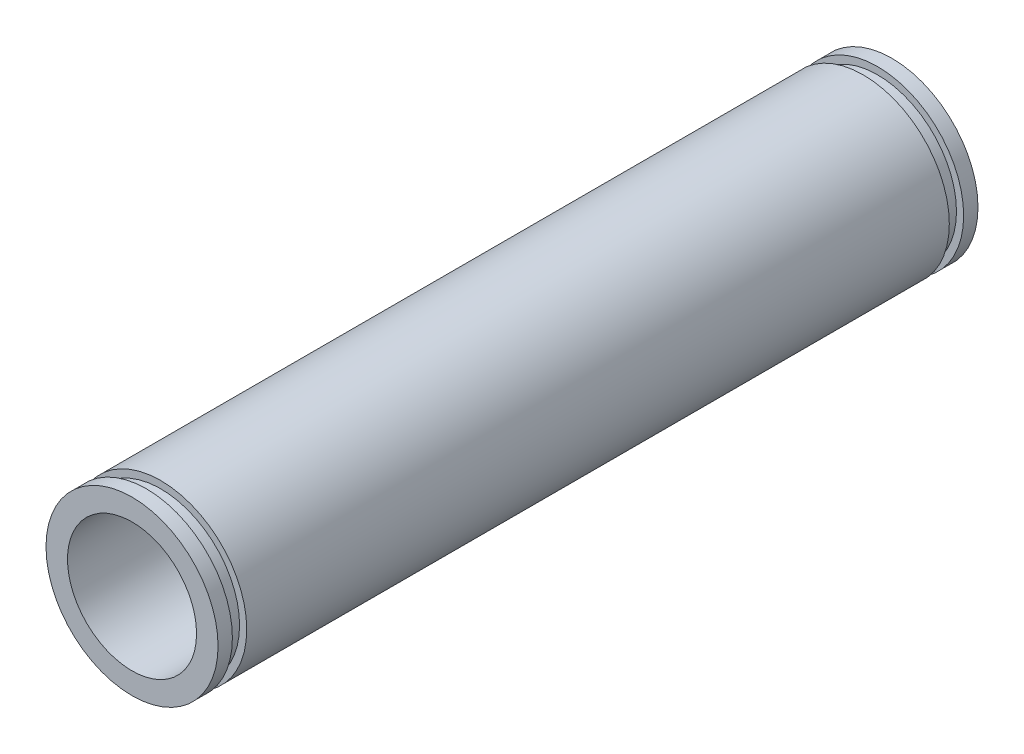
ISO-10303-21;
HEADER;
FILE_DESCRIPTION(('STEP AP214'),'2;1');
FILE_NAME('part.step','',(''),(''),'','','');
FILE_SCHEMA(('AUTOMOTIVE_DESIGN { 1 0 10303 214 1 1 1 1 }'));
ENDSEC;
DATA;
#1=APPLICATION_CONTEXT('core data for automotive mechanical design processes');
#2=APPLICATION_PROTOCOL_DEFINITION('international standard','automotive_design',2000,#1);
#3=PRODUCT_CONTEXT('',#1,'mechanical');
#4=PRODUCT('Part','Part','',(#3));
#5=PRODUCT_RELATED_PRODUCT_CATEGORY('part','',(#4));
#6=PRODUCT_DEFINITION_FORMATION('','',#4);
#7=PRODUCT_DEFINITION_CONTEXT('part definition',#1,'design');
#8=PRODUCT_DEFINITION('design','',#6,#7);
#9=PRODUCT_DEFINITION_SHAPE('','',#8);
#10=(LENGTH_UNIT() NAMED_UNIT(*) SI_UNIT(.MILLI.,.METRE.));
#11=(NAMED_UNIT(*) PLANE_ANGLE_UNIT() SI_UNIT($,.RADIAN.));
#12=(NAMED_UNIT(*) SI_UNIT($,.STERADIAN.) SOLID_ANGLE_UNIT());
#13=UNCERTAINTY_MEASURE_WITH_UNIT(LENGTH_MEASURE(1.E-05),#10,'distance_accuracy_value','');
#14=(GEOMETRIC_REPRESENTATION_CONTEXT(3) GLOBAL_UNCERTAINTY_ASSIGNED_CONTEXT((#13)) GLOBAL_UNIT_ASSIGNED_CONTEXT((#10,
#11,#12)) REPRESENTATION_CONTEXT('',''));
#15=CARTESIAN_POINT('',(0.,0.,0.));
#16=DIRECTION('',(0.,0.,1.));
#17=DIRECTION('',(1.,0.,0.));
#18=AXIS2_PLACEMENT_3D('',#15,#16,#17);
#19=CARTESIAN_POINT('',(0.,0.,26.5));
#20=DIRECTION('',(0.,0.,-1.));
#21=DIRECTION('',(-1.,0.,0.));
#22=AXIS2_PLACEMENT_3D('',#19,#20,#21);
#23=CYLINDRICAL_SURFACE('',#22,6.);
#24=CARTESIAN_POINT('',(0.,0.,24.5));
#25=DIRECTION('',(0.,0.,1.));
#26=DIRECTION('',(1.,0.,0.));
#27=AXIS2_PLACEMENT_3D('',#24,#25,#26);
#28=CIRCLE('',#27,6.);
#29=CARTESIAN_POINT('',(6.,0.,24.5));
#30=VERTEX_POINT('',#29);
#31=EDGE_CURVE('E48',#30,#30,#28,.T.);
#32=ORIENTED_EDGE('',*,*,#31,.F.);
#33=EDGE_LOOP('',(#32));
#34=FACE_BOUND('',#33,.T.);
#35=CARTESIAN_POINT('',(0.,0.,-24.5));
#36=DIRECTION('',(0.,0.,1.));
#37=DIRECTION('',(1.,0.,0.));
#38=AXIS2_PLACEMENT_3D('',#35,#36,#37);
#39=CIRCLE('',#38,6.);
#40=CARTESIAN_POINT('',(6.,0.,-24.5));
#41=VERTEX_POINT('',#40);
#42=EDGE_CURVE('E60',#41,#41,#39,.T.);
#43=ORIENTED_EDGE('',*,*,#42,.T.);
#44=EDGE_LOOP('',(#43));
#45=FACE_BOUND('',#44,.T.);
#46=ADVANCED_FACE('F32',(#34,#45),#23,.T.);
#47=CARTESIAN_POINT('',(0.,0.,-25.5));
#48=DIRECTION('',(0.,0.,1.));
#49=DIRECTION('',(1.,0.,0.));
#50=AXIS2_PLACEMENT_3D('',#47,#48,#49);
#51=CIRCLE('',#50,6.);
#52=CARTESIAN_POINT('',(6.,0.,-25.5));
#53=VERTEX_POINT('',#52);
#54=EDGE_CURVE('E63',#53,#53,#51,.T.);
#55=ORIENTED_EDGE('',*,*,#54,.F.);
#56=EDGE_LOOP('',(#55));
#57=FACE_BOUND('',#56,.T.);
#58=CARTESIAN_POINT('',(0.,0.,-26.5));
#59=DIRECTION('',(0.,0.,1.));
#60=DIRECTION('',(1.,0.,0.));
#61=AXIS2_PLACEMENT_3D('',#58,#59,#60);
#62=CIRCLE('',#61,6.);
#63=CARTESIAN_POINT('',(6.,0.,-26.5));
#64=VERTEX_POINT('',#63);
#65=EDGE_CURVE('E36',#64,#64,#62,.T.);
#66=ORIENTED_EDGE('',*,*,#65,.T.);
#67=EDGE_LOOP('',(#66));
#68=FACE_BOUND('',#67,.T.);
#69=ADVANCED_FACE('F95',(#57,#68),#23,.T.);
#70=CARTESIAN_POINT('',(0.,0.,26.5));
#71=DIRECTION('',(0.,0.,1.));
#72=DIRECTION('',(1.,0.,0.));
#73=AXIS2_PLACEMENT_3D('',#70,#71,#72);
#74=PLANE('',#73);
#75=CARTESIAN_POINT('',(0.,0.,26.5));
#76=DIRECTION('',(0.,0.,1.));
#77=DIRECTION('',(1.,0.,0.));
#78=AXIS2_PLACEMENT_3D('',#75,#76,#77);
#79=CIRCLE('',#78,6.);
#80=CARTESIAN_POINT('',(6.,0.,26.5));
#81=VERTEX_POINT('',#80);
#82=EDGE_CURVE('E10',#81,#81,#79,.T.);
#83=ORIENTED_EDGE('',*,*,#82,.T.);
#84=EDGE_LOOP('',(#83));
#85=FACE_BOUND('',#84,.T.);
#86=CARTESIAN_POINT('',(0.,0.,26.5));
#87=DIRECTION('',(0.,0.,1.));
#88=DIRECTION('',(1.,0.,0.));
#89=AXIS2_PLACEMENT_3D('',#86,#87,#88);
#90=CIRCLE('',#89,4.5);
#91=CARTESIAN_POINT('',(4.5,0.,26.5));
#92=VERTEX_POINT('',#91);
#93=EDGE_CURVE('E43',#92,#92,#90,.T.);
#94=ORIENTED_EDGE('',*,*,#93,.F.);
#95=EDGE_LOOP('',(#94));
#96=FACE_BOUND('',#95,.T.);
#97=ADVANCED_FACE('F100',(#85,#96),#74,.T.);
#98=CARTESIAN_POINT('',(0.,0.,-26.5));
#99=DIRECTION('',(0.,0.,1.));
#100=DIRECTION('',(1.,0.,0.));
#101=AXIS2_PLACEMENT_3D('',#98,#99,#100);
#102=PLANE('',#101);
#103=ORIENTED_EDGE('',*,*,#65,.F.);
#104=EDGE_LOOP('',(#103));
#105=FACE_BOUND('',#104,.T.);
#106=CARTESIAN_POINT('',(0.,0.,-26.5));
#107=DIRECTION('',(0.,0.,1.));
#108=DIRECTION('',(1.,0.,0.));
#109=AXIS2_PLACEMENT_3D('',#106,#107,#108);
#110=CIRCLE('',#109,4.5);
#111=CARTESIAN_POINT('',(4.5,0.,-26.5));
#112=VERTEX_POINT('',#111);
#113=EDGE_CURVE('E45',#112,#112,#110,.T.);
#114=ORIENTED_EDGE('',*,*,#113,.T.);
#115=EDGE_LOOP('',(#114));
#116=FACE_BOUND('',#115,.T.);
#117=ADVANCED_FACE('F106',(#105,#116),#102,.F.);
#118=CARTESIAN_POINT('',(0.,0.,25.5));
#119=DIRECTION('',(0.,0.,1.));
#120=DIRECTION('',(1.,0.,0.));
#121=AXIS2_PLACEMENT_3D('',#118,#119,#120);
#122=CIRCLE('',#121,6.);
#123=CARTESIAN_POINT('',(6.,0.,25.5));
#124=VERTEX_POINT('',#123);
#125=EDGE_CURVE('E51',#124,#124,#122,.T.);
#126=ORIENTED_EDGE('',*,*,#125,.T.);
#127=EDGE_LOOP('',(#126));
#128=FACE_BOUND('',#127,.T.);
#129=ORIENTED_EDGE('',*,*,#82,.F.);
#130=EDGE_LOOP('',(#129));
#131=FACE_BOUND('',#130,.T.);
#132=ADVANCED_FACE('F34',(#128,#131),#23,.T.);
#133=CARTESIAN_POINT('',(0.,0.,26.5));
#134=DIRECTION('',(0.,0.,-1.));
#135=DIRECTION('',(-1.,0.,0.));
#136=AXIS2_PLACEMENT_3D('',#133,#134,#135);
#137=CYLINDRICAL_SURFACE('',#136,4.5);
#138=ORIENTED_EDGE('',*,*,#93,.T.);
#139=EDGE_LOOP('',(#138));
#140=FACE_BOUND('',#139,.T.);
#141=ORIENTED_EDGE('',*,*,#113,.F.);
#142=EDGE_LOOP('',(#141));
#143=FACE_BOUND('',#142,.T.);
#144=ADVANCED_FACE('F105',(#140,#143),#137,.F.);
#145=CARTESIAN_POINT('',(0.,0.,24.5));
#146=DIRECTION('',(0.,0.,1.));
#147=DIRECTION('',(1.,0.,0.));
#148=AXIS2_PLACEMENT_3D('',#145,#146,#147);
#149=PLANE('',#148);
#150=CARTESIAN_POINT('',(0.,0.,24.5));
#151=DIRECTION('',(0.,0.,1.));
#152=DIRECTION('',(1.,0.,0.));
#153=AXIS2_PLACEMENT_3D('',#150,#151,#152);
#154=CIRCLE('',#153,5.5);
#155=CARTESIAN_POINT('',(5.5,0.,24.5));
#156=VERTEX_POINT('',#155);
#157=EDGE_CURVE('E54',#156,#156,#154,.T.);
#158=ORIENTED_EDGE('',*,*,#157,.F.);
#159=EDGE_LOOP('',(#158));
#160=FACE_BOUND('',#159,.T.);
#161=ORIENTED_EDGE('',*,*,#31,.T.);
#162=EDGE_LOOP('',(#161));
#163=FACE_BOUND('',#162,.T.);
#164=ADVANCED_FACE('F112',(#160,#163),#149,.T.);
#165=CARTESIAN_POINT('',(0.,0.,25.5));
#166=DIRECTION('',(0.,0.,1.));
#167=DIRECTION('',(1.,0.,0.));
#168=AXIS2_PLACEMENT_3D('',#165,#166,#167);
#169=PLANE('',#168);
#170=CARTESIAN_POINT('',(0.,0.,25.5));
#171=DIRECTION('',(0.,0.,1.));
#172=DIRECTION('',(1.,0.,0.));
#173=AXIS2_PLACEMENT_3D('',#170,#171,#172);
#174=CIRCLE('',#173,5.5);
#175=CARTESIAN_POINT('',(5.5,0.,25.5));
#176=VERTEX_POINT('',#175);
#177=EDGE_CURVE('E57',#176,#176,#174,.T.);
#178=ORIENTED_EDGE('',*,*,#177,.T.);
#179=EDGE_LOOP('',(#178));
#180=FACE_BOUND('',#179,.T.);
#181=ORIENTED_EDGE('',*,*,#125,.F.);
#182=EDGE_LOOP('',(#181));
#183=FACE_BOUND('',#182,.T.);
#184=ADVANCED_FACE('F119',(#180,#183),#169,.F.);
#185=CARTESIAN_POINT('',(0.,0.,24.5));
#186=DIRECTION('',(0.,0.,1.));
#187=DIRECTION('',(1.,0.,0.));
#188=AXIS2_PLACEMENT_3D('',#185,#186,#187);
#189=CYLINDRICAL_SURFACE('',#188,5.5);
#190=ORIENTED_EDGE('',*,*,#157,.T.);
#191=EDGE_LOOP('',(#190));
#192=FACE_BOUND('',#191,.T.);
#193=ORIENTED_EDGE('',*,*,#177,.F.);
#194=EDGE_LOOP('',(#193));
#195=FACE_BOUND('',#194,.T.);
#196=ADVANCED_FACE('F90',(#192,#195),#189,.T.);
#197=CARTESIAN_POINT('',(0.,0.,-24.5));
#198=DIRECTION('',(0.,0.,-1.));
#199=DIRECTION('',(1.,0.,0.));
#200=AXIS2_PLACEMENT_3D('',#197,#198,#199);
#201=PLANE('',#200);
#202=ORIENTED_EDGE('',*,*,#42,.F.);
#203=EDGE_LOOP('',(#202));
#204=FACE_BOUND('',#203,.T.);
#205=CARTESIAN_POINT('',(0.,0.,-24.5));
#206=DIRECTION('',(0.,0.,1.));
#207=DIRECTION('',(1.,0.,0.));
#208=AXIS2_PLACEMENT_3D('',#205,#206,#207);
#209=CIRCLE('',#208,5.5);
#210=CARTESIAN_POINT('',(5.5,0.,-24.5));
#211=VERTEX_POINT('',#210);
#212=EDGE_CURVE('E66',#211,#211,#209,.T.);
#213=ORIENTED_EDGE('',*,*,#212,.T.);
#214=EDGE_LOOP('',(#213));
#215=FACE_BOUND('',#214,.T.);
#216=ADVANCED_FACE('F75',(#204,#215),#201,.T.);
#217=CARTESIAN_POINT('',(0.,0.,-25.5));
#218=DIRECTION('',(0.,0.,-1.));
#219=DIRECTION('',(1.,0.,0.));
#220=AXIS2_PLACEMENT_3D('',#217,#218,#219);
#221=PLANE('',#220);
#222=ORIENTED_EDGE('',*,*,#54,.T.);
#223=EDGE_LOOP('',(#222));
#224=FACE_BOUND('',#223,.T.);
#225=CARTESIAN_POINT('',(0.,0.,-25.5));
#226=DIRECTION('',(0.,0.,1.));
#227=DIRECTION('',(1.,0.,0.));
#228=AXIS2_PLACEMENT_3D('',#225,#226,#227);
#229=CIRCLE('',#228,5.5);
#230=CARTESIAN_POINT('',(5.5,0.,-25.5));
#231=VERTEX_POINT('',#230);
#232=EDGE_CURVE('E69',#231,#231,#229,.T.);
#233=ORIENTED_EDGE('',*,*,#232,.F.);
#234=EDGE_LOOP('',(#233));
#235=FACE_BOUND('',#234,.T.);
#236=ADVANCED_FACE('F80',(#224,#235),#221,.F.);
#237=CARTESIAN_POINT('',(0.,0.,-24.5));
#238=DIRECTION('',(0.,0.,-1.));
#239=DIRECTION('',(-1.,0.,0.));
#240=AXIS2_PLACEMENT_3D('',#237,#238,#239);
#241=CYLINDRICAL_SURFACE('',#240,5.5);
#242=ORIENTED_EDGE('',*,*,#212,.F.);
#243=EDGE_LOOP('',(#242));
#244=FACE_BOUND('',#243,.T.);
#245=ORIENTED_EDGE('',*,*,#232,.T.);
#246=EDGE_LOOP('',(#245));
#247=FACE_BOUND('',#246,.T.);
#248=ADVANCED_FACE('F77',(#244,#247),#241,.T.);
#249=CLOSED_SHELL('',(#46,#69,#97,#117,#132,#144,#164,#184,#196,#216,#236,#248));
#250=MANIFOLD_SOLID_BREP('B2',#249);
#251=ADVANCED_BREP_SHAPE_REPRESENTATION('',(#18,#250),#14);
#252=SHAPE_DEFINITION_REPRESENTATION(#9,#251);
ENDSEC;
END-ISO-10303-21;
